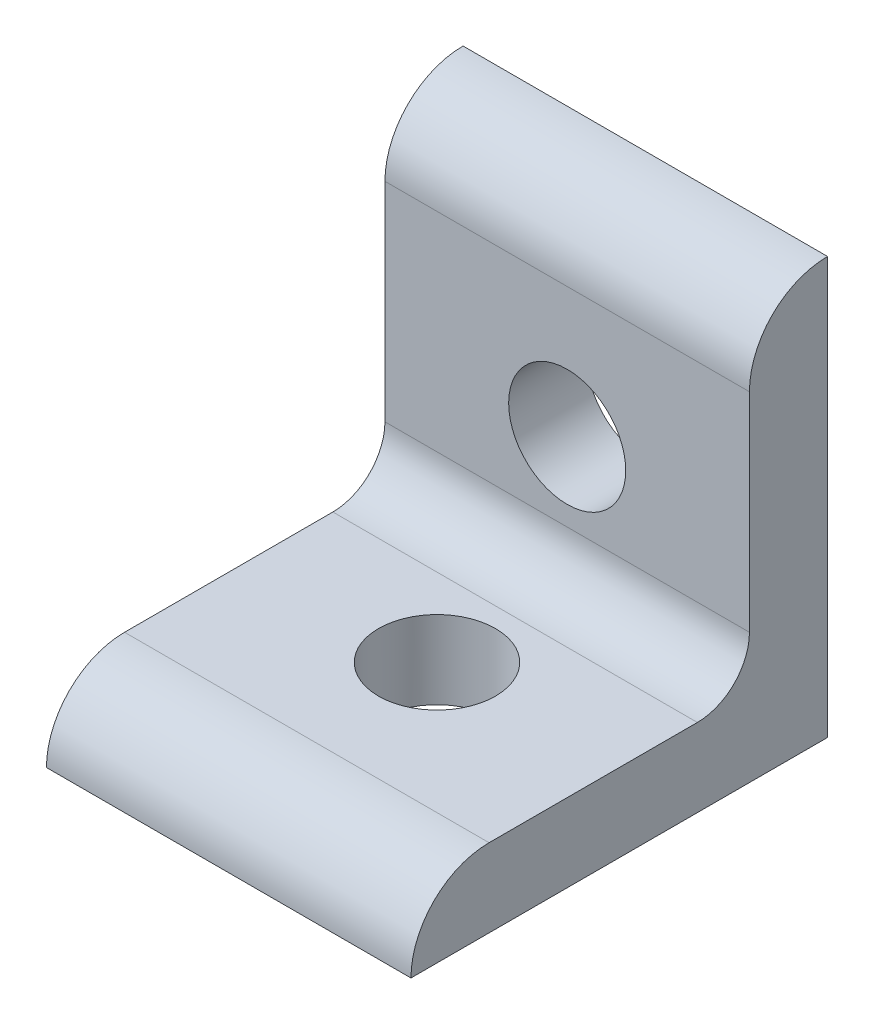
ISO-10303-21;
HEADER;
FILE_DESCRIPTION(('STEP AP214'),'2;1');
FILE_NAME('part.step','',(''),(''),'','','');
FILE_SCHEMA(('AUTOMOTIVE_DESIGN { 1 0 10303 214 1 1 1 1 }'));
ENDSEC;
DATA;
#1=APPLICATION_CONTEXT('core data for automotive mechanical design processes');
#2=APPLICATION_PROTOCOL_DEFINITION('international standard','automotive_design',2000,#1);
#3=PRODUCT_CONTEXT('',#1,'mechanical');
#4=PRODUCT('Part','Part','',(#3));
#5=PRODUCT_RELATED_PRODUCT_CATEGORY('part','',(#4));
#6=PRODUCT_DEFINITION_FORMATION('','',#4);
#7=PRODUCT_DEFINITION_CONTEXT('part definition',#1,'design');
#8=PRODUCT_DEFINITION('design','',#6,#7);
#9=PRODUCT_DEFINITION_SHAPE('','',#8);
#10=(LENGTH_UNIT() NAMED_UNIT(*) SI_UNIT(.MILLI.,.METRE.));
#11=(NAMED_UNIT(*) PLANE_ANGLE_UNIT() SI_UNIT($,.RADIAN.));
#12=(NAMED_UNIT(*) SI_UNIT($,.STERADIAN.) SOLID_ANGLE_UNIT());
#13=UNCERTAINTY_MEASURE_WITH_UNIT(LENGTH_MEASURE(1.E-05),#10,'distance_accuracy_value','');
#14=(GEOMETRIC_REPRESENTATION_CONTEXT(3) GLOBAL_UNCERTAINTY_ASSIGNED_CONTEXT((#13)) GLOBAL_UNIT_ASSIGNED_CONTEXT((#10,
#11,#12)) REPRESENTATION_CONTEXT('',''));
#15=CARTESIAN_POINT('',(0.,0.,0.));
#16=DIRECTION('',(0.,0.,1.));
#17=DIRECTION('',(1.,0.,0.));
#18=AXIS2_PLACEMENT_3D('',#15,#16,#17);
#19=CARTESIAN_POINT('',(11.1125,3.175,0.));
#20=DIRECTION('',(0.,0.,-1.));
#21=DIRECTION('',(-1.,0.,0.));
#22=AXIS2_PLACEMENT_3D('',#19,#20,#21);
#23=PLANE('',#22);
#24=CARTESIAN_POINT('',(0.,-9.525,0.));
#25=DIRECTION('',(0.,0.,-1.));
#26=DIRECTION('',(-1.,0.,0.));
#27=AXIS2_PLACEMENT_3D('',#24,#25,#26);
#28=CIRCLE('',#27,3.5687);
#29=CARTESIAN_POINT('',(-3.5687,-9.525,0.));
#30=VERTEX_POINT('',#29);
#31=EDGE_CURVE('E192',#30,#30,#28,.T.);
#32=ORIENTED_EDGE('',*,*,#31,.F.);
#33=EDGE_LOOP('',(#32));
#34=FACE_BOUND('',#33,.T.);
#35=DIRECTION('',(0.,-1.,0.));
#36=VECTOR('',#35,1.);
#37=CARTESIAN_POINT('',(-11.1125,3.175,0.));
#38=LINE('',#37,#36);
#39=CARTESIAN_POINT('',(-11.1125,3.175,0.));
#40=VERTEX_POINT('',#39);
#41=CARTESIAN_POINT('',(-11.1125,-22.225,0.));
#42=VERTEX_POINT('',#41);
#43=EDGE_CURVE('E128',#40,#42,#38,.T.);
#44=ORIENTED_EDGE('',*,*,#43,.F.);
#45=DIRECTION('',(-1.,0.,0.));
#46=VECTOR('',#45,1.);
#47=CARTESIAN_POINT('',(11.1125,3.175,0.));
#48=LINE('',#47,#46);
#49=CARTESIAN_POINT('',(11.1125,3.175,0.));
#50=VERTEX_POINT('',#49);
#51=EDGE_CURVE('E11',#50,#40,#48,.T.);
#52=ORIENTED_EDGE('',*,*,#51,.F.);
#53=DIRECTION('',(0.,-1.,0.));
#54=VECTOR('',#53,1.);
#55=CARTESIAN_POINT('',(11.1125,3.175,0.));
#56=LINE('',#55,#54);
#57=CARTESIAN_POINT('',(11.1125,-22.225,0.));
#58=VERTEX_POINT('',#57);
#59=EDGE_CURVE('E146',#50,#58,#56,.T.);
#60=ORIENTED_EDGE('',*,*,#59,.T.);
#61=DIRECTION('',(-1.,0.,0.));
#62=VECTOR('',#61,1.);
#63=CARTESIAN_POINT('',(11.1125,-22.225,0.));
#64=LINE('',#63,#62);
#65=EDGE_CURVE('E89',#58,#42,#64,.T.);
#66=ORIENTED_EDGE('',*,*,#65,.T.);
#67=EDGE_LOOP('',(#44,#52,#60,#66));
#68=FACE_BOUND('',#67,.T.);
#69=ADVANCED_FACE('F36',(#34,#68),#23,.T.);
#70=CARTESIAN_POINT('',(11.1125,-1.5875,0.));
#71=DIRECTION('',(-1.,0.,0.));
#72=DIRECTION('',(0.,0.,1.));
#73=AXIS2_PLACEMENT_3D('',#70,#71,#72);
#74=CYLINDRICAL_SURFACE('',#73,4.7625);
#75=CARTESIAN_POINT('',(-11.1125,-1.5875,0.));
#76=DIRECTION('',(-1.,0.,0.));
#77=DIRECTION('',(0.,0.,1.));
#78=AXIS2_PLACEMENT_3D('',#75,#76,#77);
#79=CIRCLE('',#78,4.7625);
#80=CARTESIAN_POINT('',(-11.1125,-1.5875,4.7625));
#81=VERTEX_POINT('',#80);
#82=EDGE_CURVE('E144',#81,#40,#79,.T.);
#83=ORIENTED_EDGE('',*,*,#82,.F.);
#84=DIRECTION('',(-1.,0.,0.));
#85=VECTOR('',#84,1.);
#86=CARTESIAN_POINT('',(11.1125,-1.5875,4.7625));
#87=LINE('',#86,#85);
#88=CARTESIAN_POINT('',(11.1125,-1.5875,4.7625));
#89=VERTEX_POINT('',#88);
#90=EDGE_CURVE('E45',#89,#81,#87,.T.);
#91=ORIENTED_EDGE('',*,*,#90,.F.);
#92=CARTESIAN_POINT('',(11.1125,-1.5875,0.));
#93=DIRECTION('',(-1.,0.,0.));
#94=DIRECTION('',(0.,0.,1.));
#95=AXIS2_PLACEMENT_3D('',#92,#93,#94);
#96=CIRCLE('',#95,4.7625);
#97=EDGE_CURVE('E118',#89,#50,#96,.T.);
#98=ORIENTED_EDGE('',*,*,#97,.T.);
#99=ORIENTED_EDGE('',*,*,#51,.T.);
#100=EDGE_LOOP('',(#83,#91,#98,#99));
#101=FACE_BOUND('',#100,.T.);
#102=ADVANCED_FACE('F157',(#101),#74,.T.);
#103=CARTESIAN_POINT('',(11.1125,-14.2875,4.7625));
#104=DIRECTION('',(0.,0.,1.));
#105=DIRECTION('',(1.,0.,0.));
#106=AXIS2_PLACEMENT_3D('',#103,#104,#105);
#107=PLANE('',#106);
#108=CARTESIAN_POINT('',(0.,-9.525,4.7625));
#109=DIRECTION('',(0.,0.,1.));
#110=DIRECTION('',(1.,0.,0.));
#111=AXIS2_PLACEMENT_3D('',#108,#109,#110);
#112=CIRCLE('',#111,3.5687);
#113=CARTESIAN_POINT('',(3.5687,-9.525,4.7625));
#114=VERTEX_POINT('',#113);
#115=EDGE_CURVE('E39',#114,#114,#112,.T.);
#116=ORIENTED_EDGE('',*,*,#115,.F.);
#117=EDGE_LOOP('',(#116));
#118=FACE_BOUND('',#117,.T.);
#119=DIRECTION('',(0.,1.,0.));
#120=VECTOR('',#119,1.);
#121=CARTESIAN_POINT('',(-11.1125,-14.2875,4.7625));
#122=LINE('',#121,#120);
#123=CARTESIAN_POINT('',(-11.1125,-14.2875,4.7625));
#124=VERTEX_POINT('',#123);
#125=EDGE_CURVE('E105',#124,#81,#122,.T.);
#126=ORIENTED_EDGE('',*,*,#125,.F.);
#127=DIRECTION('',(-1.,0.,0.));
#128=VECTOR('',#127,1.);
#129=CARTESIAN_POINT('',(11.1125,-14.2875,4.7625));
#130=LINE('',#129,#128);
#131=CARTESIAN_POINT('',(11.1125,-14.2875,4.7625));
#132=VERTEX_POINT('',#131);
#133=EDGE_CURVE('E100',#132,#124,#130,.T.);
#134=ORIENTED_EDGE('',*,*,#133,.F.);
#135=DIRECTION('',(0.,1.,0.));
#136=VECTOR('',#135,1.);
#137=CARTESIAN_POINT('',(11.1125,-14.2875,4.7625));
#138=LINE('',#137,#136);
#139=EDGE_CURVE('E103',#132,#89,#138,.T.);
#140=ORIENTED_EDGE('',*,*,#139,.T.);
#141=ORIENTED_EDGE('',*,*,#90,.T.);
#142=EDGE_LOOP('',(#126,#134,#140,#141));
#143=FACE_BOUND('',#142,.T.);
#144=ADVANCED_FACE('F102',(#118,#143),#107,.T.);
#145=CARTESIAN_POINT('',(11.1125,-14.2875,7.9375));
#146=DIRECTION('',(-1.,0.,0.));
#147=DIRECTION('',(0.,0.,1.));
#148=AXIS2_PLACEMENT_3D('',#145,#146,#147);
#149=CYLINDRICAL_SURFACE('',#148,3.175);
#150=CARTESIAN_POINT('',(-11.1125,-14.2875,7.9375));
#151=DIRECTION('',(1.,0.,0.));
#152=DIRECTION('',(0.,0.,1.));
#153=AXIS2_PLACEMENT_3D('',#150,#151,#152);
#154=CIRCLE('',#153,3.175);
#155=CARTESIAN_POINT('',(-11.1125,-17.4625,7.93750000000002));
#156=VERTEX_POINT('',#155);
#157=EDGE_CURVE('E141',#156,#124,#154,.T.);
#158=ORIENTED_EDGE('',*,*,#157,.F.);
#159=DIRECTION('',(-1.,0.,0.));
#160=VECTOR('',#159,1.);
#161=CARTESIAN_POINT('',(11.1125,-17.4625,7.93750000000002));
#162=LINE('',#161,#160);
#163=CARTESIAN_POINT('',(11.1125,-17.4625,7.93750000000002));
#164=VERTEX_POINT('',#163);
#165=EDGE_CURVE('E110',#164,#156,#162,.T.);
#166=ORIENTED_EDGE('',*,*,#165,.F.);
#167=CARTESIAN_POINT('',(11.1125,-14.2875,7.9375));
#168=DIRECTION('',(1.,0.,0.));
#169=DIRECTION('',(0.,0.,1.));
#170=AXIS2_PLACEMENT_3D('',#167,#168,#169);
#171=CIRCLE('',#170,3.175);
#172=EDGE_CURVE('E116',#164,#132,#171,.T.);
#173=ORIENTED_EDGE('',*,*,#172,.T.);
#174=ORIENTED_EDGE('',*,*,#133,.T.);
#175=EDGE_LOOP('',(#158,#166,#173,#174));
#176=FACE_BOUND('',#175,.T.);
#177=ADVANCED_FACE('F120',(#176),#149,.F.);
#178=CARTESIAN_POINT('',(11.1125,-17.4625,20.6375));
#179=DIRECTION('',(0.,1.,0.));
#180=DIRECTION('',(0.,0.,1.));
#181=AXIS2_PLACEMENT_3D('',#178,#179,#180);
#182=PLANE('',#181);
#183=CARTESIAN_POINT('',(0.,-17.4625,12.7));
#184=DIRECTION('',(0.,1.,0.));
#185=DIRECTION('',(0.,0.,1.));
#186=AXIS2_PLACEMENT_3D('',#183,#184,#185);
#187=CIRCLE('',#186,3.5687);
#188=CARTESIAN_POINT('',(0.,-17.4625,16.2687));
#189=VERTEX_POINT('',#188);
#190=EDGE_CURVE('E132',#189,#189,#187,.T.);
#191=ORIENTED_EDGE('',*,*,#190,.F.);
#192=EDGE_LOOP('',(#191));
#193=FACE_BOUND('',#192,.T.);
#194=DIRECTION('',(0.,0.,-1.));
#195=VECTOR('',#194,1.);
#196=CARTESIAN_POINT('',(-11.1125,-17.4625,20.6375));
#197=LINE('',#196,#195);
#198=CARTESIAN_POINT('',(-11.1125,-17.4625,20.6375));
#199=VERTEX_POINT('',#198);
#200=EDGE_CURVE('E138',#199,#156,#197,.T.);
#201=ORIENTED_EDGE('',*,*,#200,.F.);
#202=DIRECTION('',(-1.,0.,0.));
#203=VECTOR('',#202,1.);
#204=CARTESIAN_POINT('',(11.1125,-17.4625,20.6375));
#205=LINE('',#204,#203);
#206=CARTESIAN_POINT('',(11.1125,-17.4625,20.6375));
#207=VERTEX_POINT('',#206);
#208=EDGE_CURVE('E150',#207,#199,#205,.T.);
#209=ORIENTED_EDGE('',*,*,#208,.F.);
#210=DIRECTION('',(0.,0.,-1.));
#211=VECTOR('',#210,1.);
#212=CARTESIAN_POINT('',(11.1125,-17.4625,20.6375));
#213=LINE('',#212,#211);
#214=EDGE_CURVE('E121',#207,#164,#213,.T.);
#215=ORIENTED_EDGE('',*,*,#214,.T.);
#216=ORIENTED_EDGE('',*,*,#165,.T.);
#217=EDGE_LOOP('',(#201,#209,#215,#216));
#218=FACE_BOUND('',#217,.T.);
#219=ADVANCED_FACE('F172',(#193,#218),#182,.T.);
#220=CARTESIAN_POINT('',(11.1125,-22.225,20.6375));
#221=DIRECTION('',(-1.,0.,0.));
#222=DIRECTION('',(0.,0.,1.));
#223=AXIS2_PLACEMENT_3D('',#220,#221,#222);
#224=CYLINDRICAL_SURFACE('',#223,4.7625);
#225=CARTESIAN_POINT('',(-11.1125,-22.225,20.6375));
#226=DIRECTION('',(-1.,0.,0.));
#227=DIRECTION('',(0.,0.,1.));
#228=AXIS2_PLACEMENT_3D('',#225,#226,#227);
#229=CIRCLE('',#228,4.7625);
#230=CARTESIAN_POINT('',(-11.1125,-22.225,25.4));
#231=VERTEX_POINT('',#230);
#232=EDGE_CURVE('E135',#231,#199,#229,.T.);
#233=ORIENTED_EDGE('',*,*,#232,.F.);
#234=DIRECTION('',(-1.,0.,0.));
#235=VECTOR('',#234,1.);
#236=CARTESIAN_POINT('',(11.1125,-22.225,25.4));
#237=LINE('',#236,#235);
#238=CARTESIAN_POINT('',(11.1125,-22.225,25.4));
#239=VERTEX_POINT('',#238);
#240=EDGE_CURVE('E152',#239,#231,#237,.T.);
#241=ORIENTED_EDGE('',*,*,#240,.F.);
#242=CARTESIAN_POINT('',(11.1125,-22.225,20.6375));
#243=DIRECTION('',(-1.,0.,0.));
#244=DIRECTION('',(0.,0.,1.));
#245=AXIS2_PLACEMENT_3D('',#242,#243,#244);
#246=CIRCLE('',#245,4.7625);
#247=EDGE_CURVE('E123',#239,#207,#246,.T.);
#248=ORIENTED_EDGE('',*,*,#247,.T.);
#249=ORIENTED_EDGE('',*,*,#208,.T.);
#250=EDGE_LOOP('',(#233,#241,#248,#249));
#251=FACE_BOUND('',#250,.T.);
#252=ADVANCED_FACE('F175',(#251),#224,.T.);
#253=CARTESIAN_POINT('',(11.1125,-22.225,0.));
#254=DIRECTION('',(0.,-1.,0.));
#255=DIRECTION('',(0.,0.,-1.));
#256=AXIS2_PLACEMENT_3D('',#253,#254,#255);
#257=PLANE('',#256);
#258=CARTESIAN_POINT('',(0.,-22.225,12.7));
#259=DIRECTION('',(0.,-1.,0.));
#260=DIRECTION('',(0.,0.,-1.));
#261=AXIS2_PLACEMENT_3D('',#258,#259,#260);
#262=CIRCLE('',#261,3.5687);
#263=CARTESIAN_POINT('',(0.,-22.225,9.1313));
#264=VERTEX_POINT('',#263);
#265=EDGE_CURVE('E186',#264,#264,#262,.T.);
#266=ORIENTED_EDGE('',*,*,#265,.F.);
#267=EDGE_LOOP('',(#266));
#268=FACE_BOUND('',#267,.T.);
#269=DIRECTION('',(0.,0.,1.));
#270=VECTOR('',#269,1.);
#271=CARTESIAN_POINT('',(-11.1125,-22.225,0.));
#272=LINE('',#271,#270);
#273=EDGE_CURVE('E131',#42,#231,#272,.T.);
#274=ORIENTED_EDGE('',*,*,#273,.F.);
#275=ORIENTED_EDGE('',*,*,#65,.F.);
#276=DIRECTION('',(0.,0.,1.));
#277=VECTOR('',#276,1.);
#278=CARTESIAN_POINT('',(11.1125,-22.225,0.));
#279=LINE('',#278,#277);
#280=EDGE_CURVE('E196',#58,#239,#279,.T.);
#281=ORIENTED_EDGE('',*,*,#280,.T.);
#282=ORIENTED_EDGE('',*,*,#240,.T.);
#283=EDGE_LOOP('',(#274,#275,#281,#282));
#284=FACE_BOUND('',#283,.T.);
#285=ADVANCED_FACE('F153',(#268,#284),#257,.T.);
#286=CARTESIAN_POINT('',(11.1125,-22.225,20.6375));
#287=DIRECTION('',(-1.,0.,0.));
#288=DIRECTION('',(0.,0.,1.));
#289=AXIS2_PLACEMENT_3D('',#286,#287,#288);
#290=PLANE('',#289);
#291=ORIENTED_EDGE('',*,*,#59,.F.);
#292=ORIENTED_EDGE('',*,*,#97,.F.);
#293=ORIENTED_EDGE('',*,*,#139,.F.);
#294=ORIENTED_EDGE('',*,*,#172,.F.);
#295=ORIENTED_EDGE('',*,*,#214,.F.);
#296=ORIENTED_EDGE('',*,*,#247,.F.);
#297=ORIENTED_EDGE('',*,*,#280,.F.);
#298=EDGE_LOOP('',(#291,#292,#293,#294,#295,#296,#297));
#299=FACE_BOUND('',#298,.T.);
#300=ADVANCED_FACE('F114',(#299),#290,.F.);
#301=CARTESIAN_POINT('',(-11.1125,-22.225,20.6375));
#302=DIRECTION('',(-1.,0.,0.));
#303=DIRECTION('',(0.,0.,1.));
#304=AXIS2_PLACEMENT_3D('',#301,#302,#303);
#305=PLANE('',#304);
#306=ORIENTED_EDGE('',*,*,#43,.T.);
#307=ORIENTED_EDGE('',*,*,#273,.T.);
#308=ORIENTED_EDGE('',*,*,#232,.T.);
#309=ORIENTED_EDGE('',*,*,#200,.T.);
#310=ORIENTED_EDGE('',*,*,#157,.T.);
#311=ORIENTED_EDGE('',*,*,#125,.T.);
#312=ORIENTED_EDGE('',*,*,#82,.T.);
#313=EDGE_LOOP('',(#306,#307,#308,#309,#310,#311,#312));
#314=FACE_BOUND('',#313,.T.);
#315=ADVANCED_FACE('F156',(#314),#305,.T.);
#316=CARTESIAN_POINT('',(0.,-14.605,12.7));
#317=DIRECTION('',(0.,-1.,0.));
#318=DIRECTION('',(0.,0.,-1.));
#319=AXIS2_PLACEMENT_3D('',#316,#317,#318);
#320=CYLINDRICAL_SURFACE('',#319,3.5687);
#321=ORIENTED_EDGE('',*,*,#190,.T.);
#322=EDGE_LOOP('',(#321));
#323=FACE_BOUND('',#322,.T.);
#324=ORIENTED_EDGE('',*,*,#265,.T.);
#325=EDGE_LOOP('',(#324));
#326=FACE_BOUND('',#325,.T.);
#327=ADVANCED_FACE('F206',(#323,#326),#320,.F.);
#328=CARTESIAN_POINT('',(0.,-9.525,7.62));
#329=DIRECTION('',(0.,0.,-1.));
#330=DIRECTION('',(-1.,0.,0.));
#331=AXIS2_PLACEMENT_3D('',#328,#329,#330);
#332=CYLINDRICAL_SURFACE('',#331,3.5687);
#333=ORIENTED_EDGE('',*,*,#115,.T.);
#334=EDGE_LOOP('',(#333));
#335=FACE_BOUND('',#334,.T.);
#336=ORIENTED_EDGE('',*,*,#31,.T.);
#337=EDGE_LOOP('',(#336));
#338=FACE_BOUND('',#337,.T.);
#339=ADVANCED_FACE('F204',(#335,#338),#332,.F.);
#340=CLOSED_SHELL('',(#69,#102,#144,#177,#219,#252,#285,#300,#315,#327,#339));
#341=MANIFOLD_SOLID_BREP('B2',#340);
#342=ADVANCED_BREP_SHAPE_REPRESENTATION('',(#18,#341),#14);
#343=SHAPE_DEFINITION_REPRESENTATION(#9,#342);
ENDSEC;
END-ISO-10303-21;
